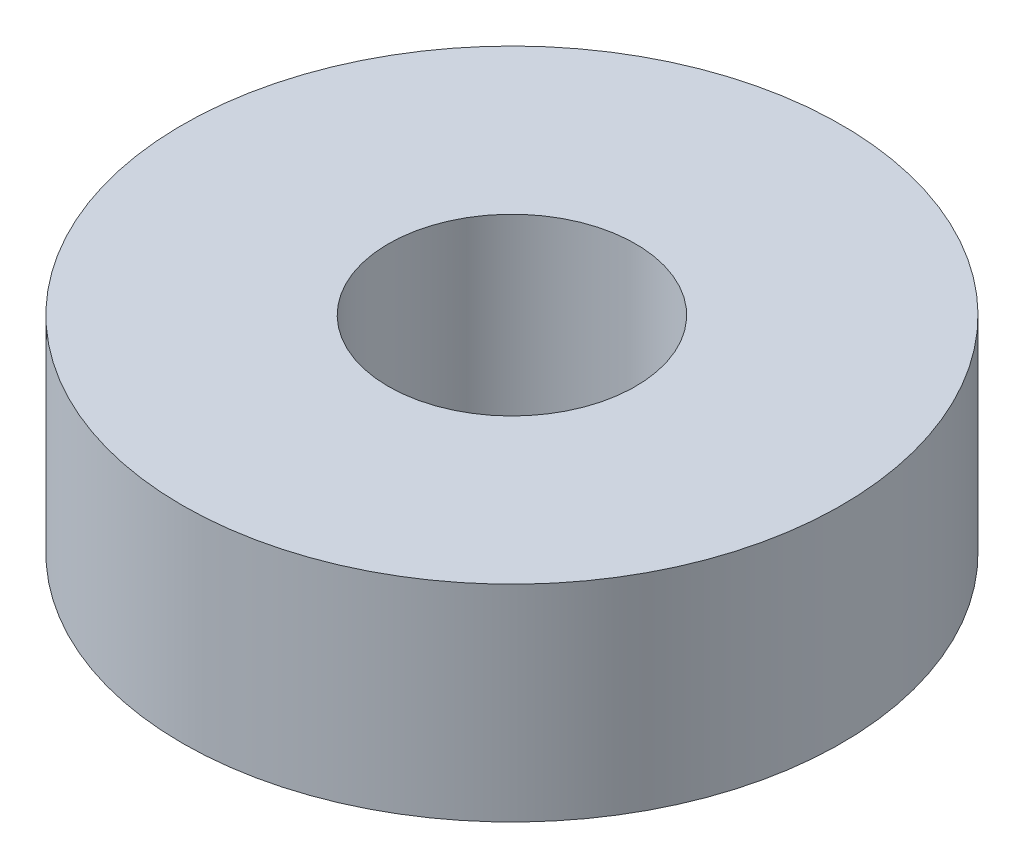
ISO-10303-21;
HEADER;
FILE_DESCRIPTION(('STEP AP214'),'2;1');
FILE_NAME('part.step','',(''),(''),'','','');
FILE_SCHEMA(('AUTOMOTIVE_DESIGN { 1 0 10303 214 1 1 1 1 }'));
ENDSEC;
DATA;
#1=APPLICATION_CONTEXT('core data for automotive mechanical design processes');
#2=APPLICATION_PROTOCOL_DEFINITION('international standard','automotive_design',2000,#1);
#3=PRODUCT_CONTEXT('',#1,'mechanical');
#4=PRODUCT('Part','Part','',(#3));
#5=PRODUCT_RELATED_PRODUCT_CATEGORY('part','',(#4));
#6=PRODUCT_DEFINITION_FORMATION('','',#4);
#7=PRODUCT_DEFINITION_CONTEXT('part definition',#1,'design');
#8=PRODUCT_DEFINITION('design','',#6,#7);
#9=PRODUCT_DEFINITION_SHAPE('','',#8);
#10=(LENGTH_UNIT() NAMED_UNIT(*) SI_UNIT(.MILLI.,.METRE.));
#11=(NAMED_UNIT(*) PLANE_ANGLE_UNIT() SI_UNIT($,.RADIAN.));
#12=(NAMED_UNIT(*) SI_UNIT($,.STERADIAN.) SOLID_ANGLE_UNIT());
#13=UNCERTAINTY_MEASURE_WITH_UNIT(LENGTH_MEASURE(1.E-05),#10,'distance_accuracy_value','');
#14=(GEOMETRIC_REPRESENTATION_CONTEXT(3) GLOBAL_UNCERTAINTY_ASSIGNED_CONTEXT((#13)) GLOBAL_UNIT_ASSIGNED_CONTEXT((#10,
#11,#12)) REPRESENTATION_CONTEXT('',''));
#15=CARTESIAN_POINT('',(0.,0.,0.));
#16=DIRECTION('',(0.,0.,1.));
#17=DIRECTION('',(1.,0.,0.));
#18=AXIS2_PLACEMENT_3D('',#15,#16,#17);
#19=CARTESIAN_POINT('',(0.,2.5,0.));
#20=DIRECTION('',(0.,1.,0.));
#21=DIRECTION('',(0.,0.,1.));
#22=AXIS2_PLACEMENT_3D('',#19,#20,#21);
#23=PLANE('',#22);
#24=CARTESIAN_POINT('',(0.,2.5,0.));
#25=DIRECTION('',(0.,1.,0.));
#26=DIRECTION('',(0.,0.,1.));
#27=AXIS2_PLACEMENT_3D('',#24,#25,#26);
#28=CIRCLE('',#27,4.);
#29=CARTESIAN_POINT('',(0.,2.5,4.));
#30=VERTEX_POINT('',#29);
#31=EDGE_CURVE('E10',#30,#30,#28,.T.);
#32=ORIENTED_EDGE('',*,*,#31,.T.);
#33=EDGE_LOOP('',(#32));
#34=FACE_BOUND('',#33,.T.);
#35=CARTESIAN_POINT('',(0.,2.5,0.));
#36=DIRECTION('',(0.,1.,0.));
#37=DIRECTION('',(0.,0.,1.));
#38=AXIS2_PLACEMENT_3D('',#35,#36,#37);
#39=CIRCLE('',#38,1.5);
#40=CARTESIAN_POINT('',(0.,2.5,1.5));
#41=VERTEX_POINT('',#40);
#42=EDGE_CURVE('E48',#41,#41,#39,.T.);
#43=ORIENTED_EDGE('',*,*,#42,.F.);
#44=EDGE_LOOP('',(#43));
#45=FACE_BOUND('',#44,.T.);
#46=ADVANCED_FACE('F37',(#34,#45),#23,.T.);
#47=CARTESIAN_POINT('',(0.,0.,0.));
#48=DIRECTION('',(0.,1.,0.));
#49=DIRECTION('',(0.,0.,1.));
#50=AXIS2_PLACEMENT_3D('',#47,#48,#49);
#51=PLANE('',#50);
#52=CARTESIAN_POINT('',(0.,0.,0.));
#53=DIRECTION('',(0.,1.,0.));
#54=DIRECTION('',(0.,0.,1.));
#55=AXIS2_PLACEMENT_3D('',#52,#53,#54);
#56=CIRCLE('',#55,4.);
#57=CARTESIAN_POINT('',(0.,0.,4.));
#58=VERTEX_POINT('',#57);
#59=EDGE_CURVE('E41',#58,#58,#56,.T.);
#60=ORIENTED_EDGE('',*,*,#59,.F.);
#61=EDGE_LOOP('',(#60));
#62=FACE_BOUND('',#61,.T.);
#63=CARTESIAN_POINT('',(0.,0.,0.));
#64=DIRECTION('',(0.,1.,0.));
#65=DIRECTION('',(0.,0.,1.));
#66=AXIS2_PLACEMENT_3D('',#63,#64,#65);
#67=CIRCLE('',#66,1.5);
#68=CARTESIAN_POINT('',(0.,0.,1.5));
#69=VERTEX_POINT('',#68);
#70=EDGE_CURVE('E50',#69,#69,#67,.T.);
#71=ORIENTED_EDGE('',*,*,#70,.T.);
#72=EDGE_LOOP('',(#71));
#73=FACE_BOUND('',#72,.T.);
#74=ADVANCED_FACE('F60',(#62,#73),#51,.F.);
#75=CARTESIAN_POINT('',(0.,2.5,0.));
#76=DIRECTION('',(0.,-1.,0.));
#77=DIRECTION('',(0.,0.,-1.));
#78=AXIS2_PLACEMENT_3D('',#75,#76,#77);
#79=CYLINDRICAL_SURFACE('',#78,4.);
#80=ORIENTED_EDGE('',*,*,#31,.F.);
#81=EDGE_LOOP('',(#80));
#82=FACE_BOUND('',#81,.T.);
#83=ORIENTED_EDGE('',*,*,#59,.T.);
#84=EDGE_LOOP('',(#83));
#85=FACE_BOUND('',#84,.T.);
#86=ADVANCED_FACE('F39',(#82,#85),#79,.T.);
#87=CARTESIAN_POINT('',(0.,2.5,0.));
#88=DIRECTION('',(0.,-1.,0.));
#89=DIRECTION('',(0.,0.,-1.));
#90=AXIS2_PLACEMENT_3D('',#87,#88,#89);
#91=CYLINDRICAL_SURFACE('',#90,1.5);
#92=ORIENTED_EDGE('',*,*,#42,.T.);
#93=EDGE_LOOP('',(#92));
#94=FACE_BOUND('',#93,.T.);
#95=ORIENTED_EDGE('',*,*,#70,.F.);
#96=EDGE_LOOP('',(#95));
#97=FACE_BOUND('',#96,.T.);
#98=ADVANCED_FACE('F56',(#94,#97),#91,.F.);
#99=CLOSED_SHELL('',(#46,#74,#86,#98));
#100=MANIFOLD_SOLID_BREP('B2',#99);
#101=ADVANCED_BREP_SHAPE_REPRESENTATION('',(#18,#100),#14);
#102=SHAPE_DEFINITION_REPRESENTATION(#9,#101);
ENDSEC;
END-ISO-10303-21;
